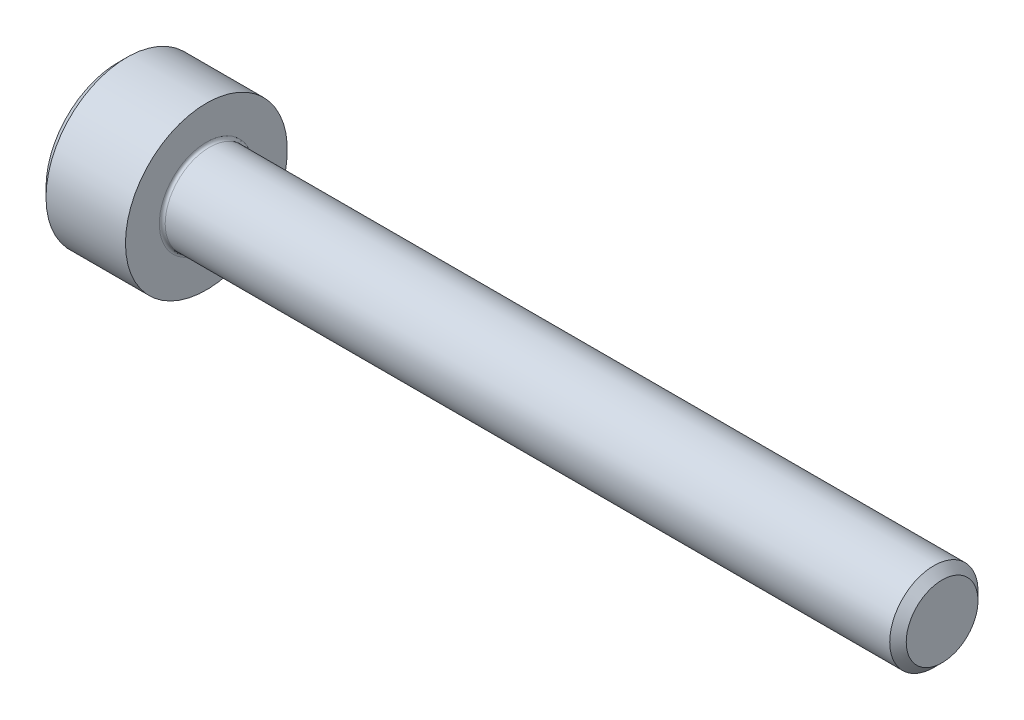
ISO-10303-21;
HEADER;
FILE_DESCRIPTION(('STEP AP214'),'2;1');
FILE_NAME('part.step','',(''),(''),'','','');
FILE_SCHEMA(('AUTOMOTIVE_DESIGN { 1 0 10303 214 1 1 1 1 }'));
ENDSEC;
DATA;
#1=APPLICATION_CONTEXT('core data for automotive mechanical design processes');
#2=APPLICATION_PROTOCOL_DEFINITION('international standard','automotive_design',2000,#1);
#3=PRODUCT_CONTEXT('',#1,'mechanical');
#4=PRODUCT('Part','Part','',(#3));
#5=PRODUCT_RELATED_PRODUCT_CATEGORY('part','',(#4));
#6=PRODUCT_DEFINITION_FORMATION('','',#4);
#7=PRODUCT_DEFINITION_CONTEXT('part definition',#1,'design');
#8=PRODUCT_DEFINITION('design','',#6,#7);
#9=PRODUCT_DEFINITION_SHAPE('','',#8);
#10=(LENGTH_UNIT() NAMED_UNIT(*) SI_UNIT(.MILLI.,.METRE.));
#11=(NAMED_UNIT(*) PLANE_ANGLE_UNIT() SI_UNIT($,.RADIAN.));
#12=(NAMED_UNIT(*) SI_UNIT($,.STERADIAN.) SOLID_ANGLE_UNIT());
#13=UNCERTAINTY_MEASURE_WITH_UNIT(LENGTH_MEASURE(1.E-05),#10,'distance_accuracy_value','');
#14=(GEOMETRIC_REPRESENTATION_CONTEXT(3) GLOBAL_UNCERTAINTY_ASSIGNED_CONTEXT((#13)) GLOBAL_UNIT_ASSIGNED_CONTEXT((#10,
#11,#12)) REPRESENTATION_CONTEXT('',''));
#15=CARTESIAN_POINT('',(0.,0.,0.));
#16=DIRECTION('',(0.,0.,1.));
#17=DIRECTION('',(1.,0.,0.));
#18=AXIS2_PLACEMENT_3D('',#15,#16,#17);
#19=CARTESIAN_POINT('',(0.,0.,0.));
#20=DIRECTION('',(-1.,0.,0.));
#21=DIRECTION('',(0.,0.,1.));
#22=AXIS2_PLACEMENT_3D('',#19,#20,#21);
#23=PLANE('',#22);
#24=DIRECTION('',(0.,-0.5,0.86602540378444));
#25=VECTOR('',#24,1.);
#26=CARTESIAN_POINT('',(0.,1.47801668912544,0.));
#27=LINE('',#26,#25);
#28=CARTESIAN_POINT('',(0.,1.47801668912544,0.));
#29=VERTEX_POINT('',#28);
#30=CARTESIAN_POINT('',(0.,0.73900834456272,1.28));
#31=VERTEX_POINT('',#30);
#32=EDGE_CURVE('E377',#29,#31,#27,.T.);
#33=ORIENTED_EDGE('',*,*,#32,.T.);
#34=DIRECTION('',(0.,1.,0.));
#35=VECTOR('',#34,1.);
#36=CARTESIAN_POINT('',(0.,-0.739008344562722,1.28));
#37=LINE('',#36,#35);
#38=CARTESIAN_POINT('',(0.,-0.739008344562722,1.28));
#39=VERTEX_POINT('',#38);
#40=EDGE_CURVE('E109',#39,#31,#37,.T.);
#41=ORIENTED_EDGE('',*,*,#40,.F.);
#42=DIRECTION('',(0.,-0.5,-0.866025403784438));
#43=VECTOR('',#42,1.);
#44=CARTESIAN_POINT('',(0.,-0.739008344562722,1.28));
#45=LINE('',#44,#43);
#46=CARTESIAN_POINT('',(0.,-1.47801668912544,0.));
#47=VERTEX_POINT('',#46);
#48=EDGE_CURVE('E380',#39,#47,#45,.T.);
#49=ORIENTED_EDGE('',*,*,#48,.T.);
#50=DIRECTION('',(0.,0.5,-0.86602540378444));
#51=VECTOR('',#50,1.);
#52=CARTESIAN_POINT('',(0.,-1.47801668912544,0.));
#53=LINE('',#52,#51);
#54=CARTESIAN_POINT('',(0.,-0.739008344562726,-1.28));
#55=VERTEX_POINT('',#54);
#56=EDGE_CURVE('E383',#47,#55,#53,.T.);
#57=ORIENTED_EDGE('',*,*,#56,.T.);
#58=DIRECTION('',(0.,-1.,0.));
#59=VECTOR('',#58,1.);
#60=CARTESIAN_POINT('',(0.,0.739008344562716,-1.28));
#61=LINE('',#60,#59);
#62=CARTESIAN_POINT('',(0.,0.739008344562716,-1.28));
#63=VERTEX_POINT('',#62);
#64=EDGE_CURVE('E386',#63,#55,#61,.T.);
#65=ORIENTED_EDGE('',*,*,#64,.F.);
#66=DIRECTION('',(0.,-0.5,-0.866025403784438));
#67=VECTOR('',#66,1.);
#68=CARTESIAN_POINT('',(0.,1.47801668912544,0.));
#69=LINE('',#68,#67);
#70=EDGE_CURVE('E104',#29,#63,#69,.T.);
#71=ORIENTED_EDGE('',*,*,#70,.F.);
#72=EDGE_LOOP('',(#33,#41,#49,#57,#65,#71));
#73=FACE_BOUND('',#72,.T.);
#74=CARTESIAN_POINT('',(0.,0.,0.));
#75=DIRECTION('',(-1.,0.,0.));
#76=DIRECTION('',(0.,0.,1.));
#77=AXIS2_PLACEMENT_3D('',#74,#75,#76);
#78=CIRCLE('',#77,2.45);
#79=CARTESIAN_POINT('',(0.,0.,2.45));
#80=VERTEX_POINT('',#79);
#81=EDGE_CURVE('E120',#80,#80,#78,.T.);
#82=ORIENTED_EDGE('',*,*,#81,.T.);
#83=EDGE_LOOP('',(#82));
#84=FACE_BOUND('',#83,.T.);
#85=ADVANCED_FACE('F17',(#73,#84),#23,.T.);
#86=CARTESIAN_POINT('',(28.,1.2195,0.));
#87=DIRECTION('',(1.,0.,0.));
#88=DIRECTION('',(0.,0.,-1.));
#89=AXIS2_PLACEMENT_3D('',#86,#87,#88);
#90=PLANE('',#89);
#91=CARTESIAN_POINT('',(28.,0.,0.));
#92=DIRECTION('',(-1.,0.,0.));
#93=DIRECTION('',(0.,0.,1.));
#94=AXIS2_PLACEMENT_3D('',#91,#92,#93);
#95=CIRCLE('',#94,1.2195);
#96=CARTESIAN_POINT('',(28.,0.,1.2195));
#97=VERTEX_POINT('',#96);
#98=EDGE_CURVE('E133',#97,#97,#95,.T.);
#99=ORIENTED_EDGE('',*,*,#98,.F.);
#100=EDGE_LOOP('',(#99));
#101=FACE_BOUND('',#100,.T.);
#102=ADVANCED_FACE('F156',(#101),#90,.T.);
#103=CARTESIAN_POINT('',(28.,0.,0.));
#104=DIRECTION('',(-1.,0.,0.));
#105=DIRECTION('',(0.,0.,1.));
#106=AXIS2_PLACEMENT_3D('',#103,#104,#105);
#107=CONICAL_SURFACE('',#106,1.2195,0.785398163397312);
#108=CARTESIAN_POINT('',(27.7195,0.,0.));
#109=DIRECTION('',(-1.,0.,0.));
#110=DIRECTION('',(0.,0.,1.));
#111=AXIS2_PLACEMENT_3D('',#108,#109,#110);
#112=CIRCLE('',#111,1.49999999999995);
#113=CARTESIAN_POINT('',(27.7195,0.,1.49999999999995));
#114=VERTEX_POINT('',#113);
#115=EDGE_CURVE('E130',#114,#114,#112,.T.);
#116=ORIENTED_EDGE('',*,*,#115,.F.);
#117=EDGE_LOOP('',(#116));
#118=FACE_BOUND('',#117,.T.);
#119=ORIENTED_EDGE('',*,*,#98,.T.);
#120=EDGE_LOOP('',(#119));
#121=FACE_BOUND('',#120,.T.);
#122=ADVANCED_FACE('F163',(#118,#121),#107,.T.);
#123=CARTESIAN_POINT('',(-31.75,0.,0.));
#124=DIRECTION('',(-1.,0.,0.));
#125=DIRECTION('',(0.,0.,1.));
#126=AXIS2_PLACEMENT_3D('',#123,#124,#125);
#127=CYLINDRICAL_SURFACE('',#126,1.49999999999998);
#128=CARTESIAN_POINT('',(3.1,0.,0.));
#129=DIRECTION('',(1.,0.,0.));
#130=DIRECTION('',(0.,0.,-1.));
#131=AXIS2_PLACEMENT_3D('',#128,#129,#130);
#132=CIRCLE('',#131,1.49999999999998);
#133=CARTESIAN_POINT('',(3.1,0.,-1.49999999999998));
#134=VERTEX_POINT('',#133);
#135=EDGE_CURVE('E11',#134,#134,#132,.T.);
#136=ORIENTED_EDGE('',*,*,#135,.T.);
#137=EDGE_LOOP('',(#136));
#138=FACE_BOUND('',#137,.T.);
#139=ORIENTED_EDGE('',*,*,#115,.T.);
#140=EDGE_LOOP('',(#139));
#141=FACE_BOUND('',#140,.T.);
#142=ADVANCED_FACE('F174',(#138,#141),#127,.T.);
#143=CARTESIAN_POINT('',(3.,2.75,0.));
#144=DIRECTION('',(1.,0.,0.));
#145=DIRECTION('',(0.,0.,-1.));
#146=AXIS2_PLACEMENT_3D('',#143,#144,#145);
#147=PLANE('',#146);
#148=CARTESIAN_POINT('',(3.,0.,0.));
#149=DIRECTION('',(1.,0.,0.));
#150=DIRECTION('',(0.,0.,-1.));
#151=AXIS2_PLACEMENT_3D('',#148,#149,#150);
#152=CIRCLE('',#151,1.6);
#153=CARTESIAN_POINT('',(3.,0.,-1.6));
#154=VERTEX_POINT('',#153);
#155=EDGE_CURVE('E25',#154,#154,#152,.F.);
#156=ORIENTED_EDGE('',*,*,#155,.T.);
#157=EDGE_LOOP('',(#156));
#158=FACE_BOUND('',#157,.T.);
#159=CARTESIAN_POINT('',(3.,0.,0.));
#160=DIRECTION('',(-1.,0.,0.));
#161=DIRECTION('',(0.,0.,1.));
#162=AXIS2_PLACEMENT_3D('',#159,#160,#161);
#163=CIRCLE('',#162,2.75);
#164=CARTESIAN_POINT('',(3.,0.,2.75));
#165=VERTEX_POINT('',#164);
#166=EDGE_CURVE('E127',#165,#165,#163,.T.);
#167=ORIENTED_EDGE('',*,*,#166,.F.);
#168=EDGE_LOOP('',(#167));
#169=FACE_BOUND('',#168,.T.);
#170=ADVANCED_FACE('F138',(#158,#169),#147,.T.);
#171=CARTESIAN_POINT('',(-31.75,0.,0.));
#172=DIRECTION('',(-1.,0.,0.));
#173=DIRECTION('',(0.,0.,1.));
#174=AXIS2_PLACEMENT_3D('',#171,#172,#173);
#175=CYLINDRICAL_SURFACE('',#174,2.75);
#176=ORIENTED_EDGE('',*,*,#166,.T.);
#177=EDGE_LOOP('',(#176));
#178=FACE_BOUND('',#177,.T.);
#179=CARTESIAN_POINT('',(0.3,0.,0.));
#180=DIRECTION('',(-1.,0.,0.));
#181=DIRECTION('',(0.,0.,1.));
#182=AXIS2_PLACEMENT_3D('',#179,#180,#181);
#183=CIRCLE('',#182,2.75);
#184=CARTESIAN_POINT('',(0.3,0.,2.75));
#185=VERTEX_POINT('',#184);
#186=EDGE_CURVE('E124',#185,#185,#183,.T.);
#187=ORIENTED_EDGE('',*,*,#186,.F.);
#188=EDGE_LOOP('',(#187));
#189=FACE_BOUND('',#188,.T.);
#190=ADVANCED_FACE('F151',(#178,#189),#175,.T.);
#191=CARTESIAN_POINT('',(0.,0.,0.));
#192=DIRECTION('',(1.,0.,0.));
#193=DIRECTION('',(0.,0.,-1.));
#194=AXIS2_PLACEMENT_3D('',#191,#192,#193);
#195=CONICAL_SURFACE('',#194,2.45,0.785398163397439);
#196=ORIENTED_EDGE('',*,*,#186,.T.);
#197=EDGE_LOOP('',(#196));
#198=FACE_BOUND('',#197,.T.);
#199=ORIENTED_EDGE('',*,*,#81,.F.);
#200=EDGE_LOOP('',(#199));
#201=FACE_BOUND('',#200,.T.);
#202=ADVANCED_FACE('F142',(#198,#201),#195,.T.);
#203=CARTESIAN_POINT('',(3.1,0.,0.));
#204=DIRECTION('',(1.,0.,0.));
#205=DIRECTION('',(0.,0.,-1.));
#206=AXIS2_PLACEMENT_3D('',#203,#204,#205);
#207=TOROIDAL_SURFACE('',#206,1.6,0.1);
#208=ORIENTED_EDGE('',*,*,#135,.F.);
#209=EDGE_LOOP('',(#208));
#210=FACE_BOUND('',#209,.T.);
#211=ORIENTED_EDGE('',*,*,#155,.F.);
#212=EDGE_LOOP('',(#211));
#213=FACE_BOUND('',#212,.T.);
#214=ADVANCED_FACE('F19',(#210,#213),#207,.F.);
#215=CARTESIAN_POINT('',(1.3,1.47801668912544,0.));
#216=DIRECTION('',(0.,-0.86602540378444,-0.5));
#217=DIRECTION('',(0.,0.5,-0.86602540378444));
#218=AXIS2_PLACEMENT_3D('',#215,#216,#217);
#219=PLANE('',#218);
#220=ORIENTED_EDGE('',*,*,#32,.F.);
#221=DIRECTION('',(-1.,0.,0.));
#222=VECTOR('',#221,1.);
#223=CARTESIAN_POINT('',(1.3,1.47801668912544,0.));
#224=LINE('',#223,#222);
#225=CARTESIAN_POINT('',(1.3,1.47801668912544,0.));
#226=VERTEX_POINT('',#225);
#227=EDGE_CURVE('E376',#226,#29,#224,.T.);
#228=ORIENTED_EDGE('',*,*,#227,.F.);
#229=DIRECTION('',(0.,-0.5,0.86602540378444));
#230=VECTOR('',#229,1.);
#231=CARTESIAN_POINT('',(1.3,1.47801668912544,0.));
#232=LINE('',#231,#230);
#233=CARTESIAN_POINT('',(1.3,1.10851251684408,0.64));
#234=VERTEX_POINT('',#233);
#235=EDGE_CURVE('E32',#226,#234,#232,.T.);
#236=ORIENTED_EDGE('',*,*,#235,.T.);
#237=CARTESIAN_POINT('',(1.3,0.73900834456272,1.28));
#238=VERTEX_POINT('',#237);
#239=EDGE_CURVE('E90',#234,#238,#232,.T.);
#240=ORIENTED_EDGE('',*,*,#239,.T.);
#241=DIRECTION('',(-1.,0.,0.));
#242=VECTOR('',#241,1.);
#243=CARTESIAN_POINT('',(1.3,0.73900834456272,1.28));
#244=LINE('',#243,#242);
#245=EDGE_CURVE('E102',#238,#31,#244,.T.);
#246=ORIENTED_EDGE('',*,*,#245,.T.);
#247=EDGE_LOOP('',(#220,#228,#236,#240,#246));
#248=FACE_BOUND('',#247,.T.);
#249=ADVANCED_FACE('F101',(#248),#219,.T.);
#250=CARTESIAN_POINT('',(1.3,-0.739008344562722,1.28));
#251=DIRECTION('',(0.,0.,1.));
#252=DIRECTION('',(0.,-1.,0.));
#253=AXIS2_PLACEMENT_3D('',#250,#251,#252);
#254=PLANE('',#253);
#255=ORIENTED_EDGE('',*,*,#40,.T.);
#256=ORIENTED_EDGE('',*,*,#245,.F.);
#257=DIRECTION('',(0.,1.,0.));
#258=VECTOR('',#257,1.);
#259=CARTESIAN_POINT('',(1.3,-0.739008344562722,1.28));
#260=LINE('',#259,#258);
#261=CARTESIAN_POINT('',(1.3,0.,1.28));
#262=VERTEX_POINT('',#261);
#263=EDGE_CURVE('E88',#262,#238,#260,.T.);
#264=ORIENTED_EDGE('',*,*,#263,.F.);
#265=CARTESIAN_POINT('',(1.3,-0.739008344562722,1.28));
#266=VERTEX_POINT('',#265);
#267=EDGE_CURVE('E98',#266,#262,#260,.T.);
#268=ORIENTED_EDGE('',*,*,#267,.F.);
#269=DIRECTION('',(-1.,0.,0.));
#270=VECTOR('',#269,1.);
#271=CARTESIAN_POINT('',(1.3,-0.739008344562722,1.28));
#272=LINE('',#271,#270);
#273=EDGE_CURVE('E111',#266,#39,#272,.T.);
#274=ORIENTED_EDGE('',*,*,#273,.T.);
#275=EDGE_LOOP('',(#255,#256,#264,#268,#274));
#276=FACE_BOUND('',#275,.T.);
#277=ADVANCED_FACE('F106',(#276),#254,.F.);
#278=CARTESIAN_POINT('',(1.3,-0.739008344562722,1.28));
#279=DIRECTION('',(0.,0.866025403784438,-0.5));
#280=DIRECTION('',(0.,0.5,0.866025403784438));
#281=AXIS2_PLACEMENT_3D('',#278,#279,#280);
#282=PLANE('',#281);
#283=ORIENTED_EDGE('',*,*,#48,.F.);
#284=ORIENTED_EDGE('',*,*,#273,.F.);
#285=DIRECTION('',(0.,-0.5,-0.866025403784438));
#286=VECTOR('',#285,1.);
#287=CARTESIAN_POINT('',(1.3,-0.739008344562722,1.28));
#288=LINE('',#287,#286);
#289=CARTESIAN_POINT('',(1.3,-1.10851251684408,0.64));
#290=VERTEX_POINT('',#289);
#291=EDGE_CURVE('E355',#266,#290,#288,.T.);
#292=ORIENTED_EDGE('',*,*,#291,.T.);
#293=CARTESIAN_POINT('',(1.3,-1.47801668912544,0.));
#294=VERTEX_POINT('',#293);
#295=EDGE_CURVE('E357',#290,#294,#288,.T.);
#296=ORIENTED_EDGE('',*,*,#295,.T.);
#297=DIRECTION('',(-1.,0.,0.));
#298=VECTOR('',#297,1.);
#299=CARTESIAN_POINT('',(1.3,-1.47801668912544,0.));
#300=LINE('',#299,#298);
#301=EDGE_CURVE('E116',#294,#47,#300,.T.);
#302=ORIENTED_EDGE('',*,*,#301,.T.);
#303=EDGE_LOOP('',(#283,#284,#292,#296,#302));
#304=FACE_BOUND('',#303,.T.);
#305=ADVANCED_FACE('F233',(#304),#282,.T.);
#306=CARTESIAN_POINT('',(1.3,-1.47801668912544,0.));
#307=DIRECTION('',(0.,0.86602540378444,0.5));
#308=DIRECTION('',(0.,-0.5,0.86602540378444));
#309=AXIS2_PLACEMENT_3D('',#306,#307,#308);
#310=PLANE('',#309);
#311=ORIENTED_EDGE('',*,*,#56,.F.);
#312=ORIENTED_EDGE('',*,*,#301,.F.);
#313=DIRECTION('',(0.,0.5,-0.86602540378444));
#314=VECTOR('',#313,1.);
#315=CARTESIAN_POINT('',(1.3,-1.47801668912544,0.));
#316=LINE('',#315,#314);
#317=CARTESIAN_POINT('',(1.3,-1.10851251684409,-0.64));
#318=VERTEX_POINT('',#317);
#319=EDGE_CURVE('E360',#294,#318,#316,.T.);
#320=ORIENTED_EDGE('',*,*,#319,.T.);
#321=CARTESIAN_POINT('',(1.3,-0.739008344562726,-1.28));
#322=VERTEX_POINT('',#321);
#323=EDGE_CURVE('E364',#318,#322,#316,.T.);
#324=ORIENTED_EDGE('',*,*,#323,.T.);
#325=DIRECTION('',(-1.,0.,0.));
#326=VECTOR('',#325,1.);
#327=CARTESIAN_POINT('',(1.3,-0.739008344562726,-1.28));
#328=LINE('',#327,#326);
#329=EDGE_CURVE('E395',#322,#55,#328,.T.);
#330=ORIENTED_EDGE('',*,*,#329,.T.);
#331=EDGE_LOOP('',(#311,#312,#320,#324,#330));
#332=FACE_BOUND('',#331,.T.);
#333=ADVANCED_FACE('F243',(#332),#310,.T.);
#334=CARTESIAN_POINT('',(1.3,0.739008344562716,-1.28));
#335=DIRECTION('',(0.,0.,-1.));
#336=DIRECTION('',(0.,1.,0.));
#337=AXIS2_PLACEMENT_3D('',#334,#335,#336);
#338=PLANE('',#337);
#339=ORIENTED_EDGE('',*,*,#64,.T.);
#340=ORIENTED_EDGE('',*,*,#329,.F.);
#341=DIRECTION('',(0.,-1.,0.));
#342=VECTOR('',#341,1.);
#343=CARTESIAN_POINT('',(1.3,0.739008344562716,-1.28));
#344=LINE('',#343,#342);
#345=CARTESIAN_POINT('',(1.3,0.,-1.28));
#346=VERTEX_POINT('',#345);
#347=EDGE_CURVE('E368',#346,#322,#344,.T.);
#348=ORIENTED_EDGE('',*,*,#347,.F.);
#349=CARTESIAN_POINT('',(1.3,0.739008344562716,-1.28));
#350=VERTEX_POINT('',#349);
#351=EDGE_CURVE('E369',#350,#346,#344,.T.);
#352=ORIENTED_EDGE('',*,*,#351,.F.);
#353=DIRECTION('',(-1.,0.,0.));
#354=VECTOR('',#353,1.);
#355=CARTESIAN_POINT('',(1.3,0.739008344562716,-1.28));
#356=LINE('',#355,#354);
#357=EDGE_CURVE('E392',#350,#63,#356,.T.);
#358=ORIENTED_EDGE('',*,*,#357,.T.);
#359=EDGE_LOOP('',(#339,#340,#348,#352,#358));
#360=FACE_BOUND('',#359,.T.);
#361=ADVANCED_FACE('F253',(#360),#338,.F.);
#362=CARTESIAN_POINT('',(1.3,1.47801668912544,0.));
#363=DIRECTION('',(0.,0.866025403784438,-0.5));
#364=DIRECTION('',(0.,0.5,0.866025403784438));
#365=AXIS2_PLACEMENT_3D('',#362,#363,#364);
#366=PLANE('',#365);
#367=ORIENTED_EDGE('',*,*,#70,.T.);
#368=ORIENTED_EDGE('',*,*,#357,.F.);
#369=DIRECTION('',(0.,-0.5,-0.866025403784438));
#370=VECTOR('',#369,1.);
#371=CARTESIAN_POINT('',(1.3,1.47801668912544,0.));
#372=LINE('',#371,#370);
#373=CARTESIAN_POINT('',(1.3,1.10851251684408,-0.64));
#374=VERTEX_POINT('',#373);
#375=EDGE_CURVE('E372',#374,#350,#372,.T.);
#376=ORIENTED_EDGE('',*,*,#375,.F.);
#377=EDGE_CURVE('E373',#226,#374,#372,.T.);
#378=ORIENTED_EDGE('',*,*,#377,.F.);
#379=ORIENTED_EDGE('',*,*,#227,.T.);
#380=EDGE_LOOP('',(#367,#368,#376,#378,#379));
#381=FACE_BOUND('',#380,.T.);
#382=ADVANCED_FACE('F263',(#381),#366,.F.);
#383=CARTESIAN_POINT('',(1.3,0.73900834456272,1.28));
#384=DIRECTION('',(-1.,0.,0.));
#385=DIRECTION('',(0.,0.,1.));
#386=AXIS2_PLACEMENT_3D('',#383,#384,#385);
#387=PLANE('',#386);
#388=CARTESIAN_POINT('',(1.3,0.,0.));
#389=DIRECTION('',(-1.,0.,0.));
#390=DIRECTION('',(0.,0.,1.));
#391=AXIS2_PLACEMENT_3D('',#388,#389,#390);
#392=CIRCLE('',#391,1.28);
#393=EDGE_CURVE('E110',#290,#262,#392,.T.);
#394=ORIENTED_EDGE('',*,*,#393,.F.);
#395=ORIENTED_EDGE('',*,*,#291,.F.);
#396=ORIENTED_EDGE('',*,*,#267,.T.);
#397=EDGE_LOOP('',(#394,#395,#396));
#398=FACE_BOUND('',#397,.T.);
#399=ADVANCED_FACE('F273',(#398),#387,.T.);
#400=EDGE_CURVE('E114',#318,#290,#392,.T.);
#401=ORIENTED_EDGE('',*,*,#400,.F.);
#402=ORIENTED_EDGE('',*,*,#319,.F.);
#403=ORIENTED_EDGE('',*,*,#295,.F.);
#404=EDGE_LOOP('',(#401,#402,#403));
#405=FACE_BOUND('',#404,.T.);
#406=ADVANCED_FACE('F283',(#405),#387,.T.);
#407=EDGE_CURVE('E403',#346,#318,#392,.T.);
#408=ORIENTED_EDGE('',*,*,#407,.F.);
#409=ORIENTED_EDGE('',*,*,#347,.T.);
#410=ORIENTED_EDGE('',*,*,#323,.F.);
#411=EDGE_LOOP('',(#408,#409,#410));
#412=FACE_BOUND('',#411,.T.);
#413=ADVANCED_FACE('F293',(#412),#387,.T.);
#414=EDGE_CURVE('E402',#374,#346,#392,.T.);
#415=ORIENTED_EDGE('',*,*,#414,.F.);
#416=ORIENTED_EDGE('',*,*,#375,.T.);
#417=ORIENTED_EDGE('',*,*,#351,.T.);
#418=EDGE_LOOP('',(#415,#416,#417));
#419=FACE_BOUND('',#418,.T.);
#420=ADVANCED_FACE('F302',(#419),#387,.T.);
#421=EDGE_CURVE('E121',#234,#374,#392,.T.);
#422=ORIENTED_EDGE('',*,*,#421,.F.);
#423=ORIENTED_EDGE('',*,*,#235,.F.);
#424=ORIENTED_EDGE('',*,*,#377,.T.);
#425=EDGE_LOOP('',(#422,#423,#424));
#426=FACE_BOUND('',#425,.T.);
#427=ADVANCED_FACE('F311',(#426),#387,.T.);
#428=EDGE_CURVE('E93',#262,#234,#392,.T.);
#429=ORIENTED_EDGE('',*,*,#428,.F.);
#430=ORIENTED_EDGE('',*,*,#263,.T.);
#431=ORIENTED_EDGE('',*,*,#239,.F.);
#432=EDGE_LOOP('',(#429,#430,#431));
#433=FACE_BOUND('',#432,.T.);
#434=ADVANCED_FACE('F89',(#433),#387,.T.);
#435=CARTESIAN_POINT('',(1.3,0.,0.));
#436=DIRECTION('',(-1.,0.,0.));
#437=DIRECTION('',(0.,0.,1.));
#438=AXIS2_PLACEMENT_3D('',#435,#436,#437);
#439=CONICAL_SURFACE('',#438,1.28,1.0471975511966);
#440=CARTESIAN_POINT('',(2.03900834456273,0.,0.));
#441=VERTEX_POINT('',#440);
#442=VERTEX_LOOP('',#441);
#443=FACE_BOUND('',#442,.T.);
#444=ORIENTED_EDGE('',*,*,#428,.T.);
#445=ORIENTED_EDGE('',*,*,#421,.T.);
#446=ORIENTED_EDGE('',*,*,#414,.T.);
#447=ORIENTED_EDGE('',*,*,#407,.T.);
#448=ORIENTED_EDGE('',*,*,#400,.T.);
#449=ORIENTED_EDGE('',*,*,#393,.T.);
#450=EDGE_LOOP('',(#444,#445,#446,#447,#448,#449));
#451=FACE_BOUND('',#450,.T.);
#452=ADVANCED_FACE('F167',(#443,#451),#439,.F.);
#453=CLOSED_SHELL('',(#85,#102,#122,#142,#170,#190,#202,#214,#249,#277,#305,#333,#361,#382,#399,
#406,#413,#420,#427,#434,#452));
#454=MANIFOLD_SOLID_BREP('B1',#453);
#455=ADVANCED_BREP_SHAPE_REPRESENTATION('',(#18,#454),#14);
#456=SHAPE_DEFINITION_REPRESENTATION(#9,#455);
ENDSEC;
END-ISO-10303-21;
